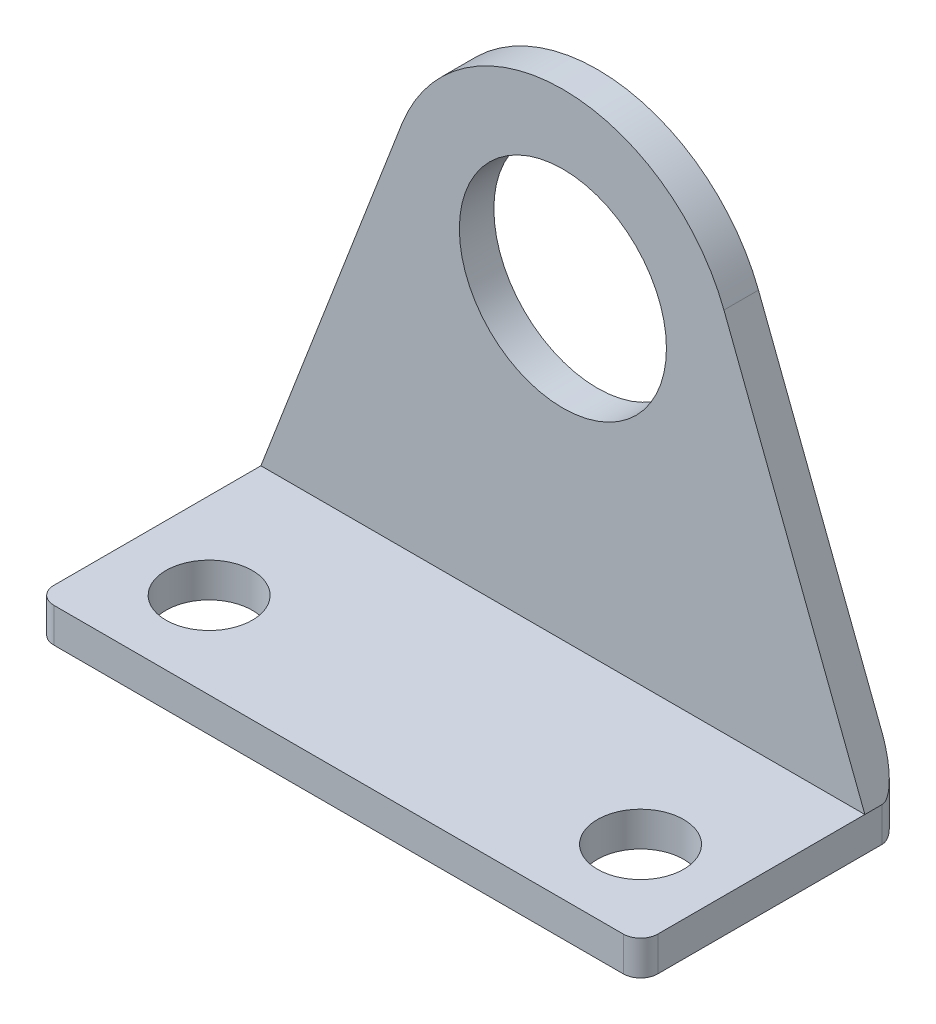
ISO-10303-21;
HEADER;
FILE_DESCRIPTION(('STEP AP214'),'2;1');
FILE_NAME('part.step','',(''),(''),'','','');
FILE_SCHEMA(('AUTOMOTIVE_DESIGN { 1 0 10303 214 1 1 1 1 }'));
ENDSEC;
DATA;
#1=APPLICATION_CONTEXT('core data for automotive mechanical design processes');
#2=APPLICATION_PROTOCOL_DEFINITION('international standard','automotive_design',2000,#1);
#3=PRODUCT_CONTEXT('',#1,'mechanical');
#4=PRODUCT('Part','Part','',(#3));
#5=PRODUCT_RELATED_PRODUCT_CATEGORY('part','',(#4));
#6=PRODUCT_DEFINITION_FORMATION('','',#4);
#7=PRODUCT_DEFINITION_CONTEXT('part definition',#1,'design');
#8=PRODUCT_DEFINITION('design','',#6,#7);
#9=PRODUCT_DEFINITION_SHAPE('','',#8);
#10=(LENGTH_UNIT() NAMED_UNIT(*) SI_UNIT(.MILLI.,.METRE.));
#11=(NAMED_UNIT(*) PLANE_ANGLE_UNIT() SI_UNIT($,.RADIAN.));
#12=(NAMED_UNIT(*) SI_UNIT($,.STERADIAN.) SOLID_ANGLE_UNIT());
#13=UNCERTAINTY_MEASURE_WITH_UNIT(LENGTH_MEASURE(1.E-05),#10,'distance_accuracy_value','');
#14=(GEOMETRIC_REPRESENTATION_CONTEXT(3) GLOBAL_UNCERTAINTY_ASSIGNED_CONTEXT((#13)) GLOBAL_UNIT_ASSIGNED_CONTEXT((#10,
#11,#12)) REPRESENTATION_CONTEXT('',''));
#15=CARTESIAN_POINT('',(0.,0.,0.));
#16=DIRECTION('',(0.,0.,1.));
#17=DIRECTION('',(1.,0.,0.));
#18=AXIS2_PLACEMENT_3D('',#15,#16,#17);
#19=CARTESIAN_POINT('',(0.,2.,0.));
#20=DIRECTION('',(1.,0.,0.));
#21=DIRECTION('',(0.,0.,-1.));
#22=AXIS2_PLACEMENT_3D('',#19,#20,#21);
#23=PLANE('',#22);
#24=DIRECTION('',(0.,0.,1.));
#25=VECTOR('',#24,1.);
#26=CARTESIAN_POINT('',(0.,0.,0.));
#27=LINE('',#26,#25);
#28=CARTESIAN_POINT('',(0.,0.,-14.));
#29=VERTEX_POINT('',#28);
#30=CARTESIAN_POINT('',(0.,0.,-1.));
#31=VERTEX_POINT('',#30);
#32=EDGE_CURVE('E159',#29,#31,#27,.T.);
#33=ORIENTED_EDGE('',*,*,#32,.T.);
#34=DIRECTION('',(0.,-1.,0.));
#35=VECTOR('',#34,1.);
#36=CARTESIAN_POINT('',(0.,2.,-1.));
#37=LINE('',#36,#35);
#38=CARTESIAN_POINT('',(0.,2.,-1.));
#39=VERTEX_POINT('',#38);
#40=EDGE_CURVE('E11',#31,#39,#37,.F.);
#41=ORIENTED_EDGE('',*,*,#40,.T.);
#42=DIRECTION('',(0.,0.,1.));
#43=VECTOR('',#42,1.);
#44=CARTESIAN_POINT('',(0.,2.,0.));
#45=LINE('',#44,#43);
#46=CARTESIAN_POINT('',(0.,2.,-13.));
#47=VERTEX_POINT('',#46);
#48=EDGE_CURVE('E169',#47,#39,#45,.T.);
#49=ORIENTED_EDGE('',*,*,#48,.F.);
#50=CARTESIAN_POINT('',(0.,2.,-14.));
#51=VERTEX_POINT('',#50);
#52=EDGE_CURVE('E167',#51,#47,#45,.T.);
#53=ORIENTED_EDGE('',*,*,#52,.F.);
#54=DIRECTION('',(0.,-1.,0.));
#55=VECTOR('',#54,1.);
#56=CARTESIAN_POINT('',(0.,2.,-14.));
#57=LINE('',#56,#55);
#58=EDGE_CURVE('E191',#51,#29,#57,.T.);
#59=ORIENTED_EDGE('',*,*,#58,.T.);
#60=EDGE_LOOP('',(#33,#41,#49,#53,#59));
#61=FACE_BOUND('',#60,.T.);
#62=ADVANCED_FACE('F39',(#61),#23,.F.);
#63=CARTESIAN_POINT('',(0.,2.,0.));
#64=DIRECTION('',(0.,0.,-1.));
#65=DIRECTION('',(-1.,0.,0.));
#66=AXIS2_PLACEMENT_3D('',#63,#64,#65);
#67=PLANE('',#66);
#68=DIRECTION('',(1.,0.,0.));
#69=VECTOR('',#68,1.);
#70=CARTESIAN_POINT('',(0.,0.,0.));
#71=LINE('',#70,#69);
#72=CARTESIAN_POINT('',(1.,0.,0.));
#73=VERTEX_POINT('',#72);
#74=CARTESIAN_POINT('',(34.,0.,0.));
#75=VERTEX_POINT('',#74);
#76=EDGE_CURVE('E161',#73,#75,#71,.T.);
#77=ORIENTED_EDGE('',*,*,#76,.T.);
#78=DIRECTION('',(0.,-1.,0.));
#79=VECTOR('',#78,1.);
#80=CARTESIAN_POINT('',(34.,2.,0.));
#81=LINE('',#80,#79);
#82=CARTESIAN_POINT('',(34.,2.,0.));
#83=VERTEX_POINT('',#82);
#84=EDGE_CURVE('E60',#75,#83,#81,.F.);
#85=ORIENTED_EDGE('',*,*,#84,.T.);
#86=DIRECTION('',(1.,0.,0.));
#87=VECTOR('',#86,1.);
#88=CARTESIAN_POINT('',(0.,2.,0.));
#89=LINE('',#88,#87);
#90=CARTESIAN_POINT('',(1.,2.,0.));
#91=VERTEX_POINT('',#90);
#92=EDGE_CURVE('E135',#91,#83,#89,.T.);
#93=ORIENTED_EDGE('',*,*,#92,.F.);
#94=DIRECTION('',(0.,-1.,0.));
#95=VECTOR('',#94,1.);
#96=CARTESIAN_POINT('',(1.,2.,0.));
#97=LINE('',#96,#95);
#98=EDGE_CURVE('E211',#91,#73,#97,.T.);
#99=ORIENTED_EDGE('',*,*,#98,.T.);
#100=EDGE_LOOP('',(#77,#85,#93,#99));
#101=FACE_BOUND('',#100,.T.);
#102=ADVANCED_FACE('F219',(#101),#67,.F.);
#103=CARTESIAN_POINT('',(35.,2.,0.));
#104=DIRECTION('',(-1.,0.,0.));
#105=DIRECTION('',(0.,0.,1.));
#106=AXIS2_PLACEMENT_3D('',#103,#104,#105);
#107=PLANE('',#106);
#108=DIRECTION('',(0.,0.,-1.));
#109=VECTOR('',#108,1.);
#110=CARTESIAN_POINT('',(35.,2.,0.));
#111=LINE('',#110,#109);
#112=CARTESIAN_POINT('',(35.,2.,-1.));
#113=VERTEX_POINT('',#112);
#114=CARTESIAN_POINT('',(35.,2.,-13.));
#115=VERTEX_POINT('',#114);
#116=EDGE_CURVE('E124',#113,#115,#111,.T.);
#117=ORIENTED_EDGE('',*,*,#116,.F.);
#118=DIRECTION('',(0.,-1.,0.));
#119=VECTOR('',#118,1.);
#120=CARTESIAN_POINT('',(35.,2.,-1.));
#121=LINE('',#120,#119);
#122=CARTESIAN_POINT('',(35.,0.,-1.));
#123=VERTEX_POINT('',#122);
#124=EDGE_CURVE('E198',#113,#123,#121,.T.);
#125=ORIENTED_EDGE('',*,*,#124,.T.);
#126=DIRECTION('',(0.,0.,-1.));
#127=VECTOR('',#126,1.);
#128=CARTESIAN_POINT('',(35.,0.,0.));
#129=LINE('',#128,#127);
#130=CARTESIAN_POINT('',(35.,0.,-14.));
#131=VERTEX_POINT('',#130);
#132=EDGE_CURVE('E172',#123,#131,#129,.T.);
#133=ORIENTED_EDGE('',*,*,#132,.T.);
#134=DIRECTION('',(0.,-1.,0.));
#135=VECTOR('',#134,1.);
#136=CARTESIAN_POINT('',(35.,2.,-14.));
#137=LINE('',#136,#135);
#138=CARTESIAN_POINT('',(35.,2.,-14.));
#139=VERTEX_POINT('',#138);
#140=EDGE_CURVE('E158',#131,#139,#137,.F.);
#141=ORIENTED_EDGE('',*,*,#140,.T.);
#142=DIRECTION('',(0.,0.,-1.));
#143=VECTOR('',#142,1.);
#144=CARTESIAN_POINT('',(35.,2.,-13.));
#145=LINE('',#144,#143);
#146=EDGE_CURVE('E142',#115,#139,#145,.T.);
#147=ORIENTED_EDGE('',*,*,#146,.F.);
#148=EDGE_LOOP('',(#117,#125,#133,#141,#147));
#149=FACE_BOUND('',#148,.T.);
#150=ADVANCED_FACE('F156',(#149),#107,.F.);
#151=CARTESIAN_POINT('',(0.,2.,-15.));
#152=DIRECTION('',(0.,0.,1.));
#153=DIRECTION('',(1.,0.,0.));
#154=AXIS2_PLACEMENT_3D('',#151,#152,#153);
#155=PLANE('',#154);
#156=CARTESIAN_POINT('',(17.5,19.6432234456318,-15.));
#157=DIRECTION('',(0.,0.,1.));
#158=DIRECTION('',(1.,0.,0.));
#159=AXIS2_PLACEMENT_3D('',#156,#157,#158);
#160=CIRCLE('',#159,6.);
#161=CARTESIAN_POINT('',(23.5,19.6432234456318,-15.));
#162=VERTEX_POINT('',#161);
#163=EDGE_CURVE('E249',#162,#162,#160,.T.);
#164=ORIENTED_EDGE('',*,*,#163,.T.);
#165=EDGE_LOOP('',(#164));
#166=FACE_BOUND('',#165,.T.);
#167=DIRECTION('',(0.358979079308869,-0.93334560620306,0.));
#168=VECTOR('',#167,1.);
#169=CARTESIAN_POINT('',(35.,2.,-15.));
#170=LINE('',#169,#168);
#171=CARTESIAN_POINT('',(26.8334560620306,23.2330142387205,-15.));
#172=VERTEX_POINT('',#171);
#173=CARTESIAN_POINT('',(34.,4.6,-15.));
#174=VERTEX_POINT('',#173);
#175=EDGE_CURVE('E205',#172,#174,#170,.T.);
#176=ORIENTED_EDGE('',*,*,#175,.T.);
#177=DIRECTION('',(0.,-1.,0.));
#178=VECTOR('',#177,1.);
#179=CARTESIAN_POINT('',(34.,2.,-15.));
#180=LINE('',#179,#178);
#181=CARTESIAN_POINT('',(34.,1.,-15.));
#182=VERTEX_POINT('',#181);
#183=EDGE_CURVE('E185',#174,#182,#180,.T.);
#184=ORIENTED_EDGE('',*,*,#183,.T.);
#185=DIRECTION('',(-1.,0.,0.));
#186=VECTOR('',#185,1.);
#187=CARTESIAN_POINT('',(0.,1.,-15.));
#188=LINE('',#187,#186);
#189=CARTESIAN_POINT('',(1.,1.,-15.));
#190=VERTEX_POINT('',#189);
#191=EDGE_CURVE('E181',#182,#190,#188,.T.);
#192=ORIENTED_EDGE('',*,*,#191,.T.);
#193=DIRECTION('',(0.,-1.,0.));
#194=VECTOR('',#193,1.);
#195=CARTESIAN_POINT('',(1.,2.,-15.));
#196=LINE('',#195,#194);
#197=CARTESIAN_POINT('',(0.999999999999997,4.6,-15.));
#198=VERTEX_POINT('',#197);
#199=EDGE_CURVE('E183',#190,#198,#196,.F.);
#200=ORIENTED_EDGE('',*,*,#199,.T.);
#201=DIRECTION('',(0.358979079308869,0.93334560620306,0.));
#202=VECTOR('',#201,1.);
#203=CARTESIAN_POINT('',(17.5,47.5,-15.));
#204=LINE('',#203,#202);
#205=CARTESIAN_POINT('',(8.1665439379694,23.2330142387205,-15.));
#206=VERTEX_POINT('',#205);
#207=EDGE_CURVE('E149',#198,#206,#204,.T.);
#208=ORIENTED_EDGE('',*,*,#207,.T.);
#209=CARTESIAN_POINT('',(17.5,19.6432234456318,-15.));
#210=DIRECTION('',(0.,0.,1.));
#211=DIRECTION('',(1.,0.,0.));
#212=AXIS2_PLACEMENT_3D('',#209,#210,#211);
#213=CIRCLE('',#212,10.);
#214=EDGE_CURVE('E176',#206,#172,#213,.F.);
#215=ORIENTED_EDGE('',*,*,#214,.T.);
#216=EDGE_LOOP('',(#176,#184,#192,#200,#208,#215));
#217=FACE_BOUND('',#216,.T.);
#218=ADVANCED_FACE('F242',(#166,#217),#155,.F.);
#219=CARTESIAN_POINT('',(0.,2.,0.));
#220=DIRECTION('',(0.,-1.,0.));
#221=DIRECTION('',(0.,0.,-1.));
#222=AXIS2_PLACEMENT_3D('',#219,#220,#221);
#223=PLANE('',#222);
#224=CARTESIAN_POINT('',(5.,2.,-5.));
#225=DIRECTION('',(0.,1.,0.));
#226=DIRECTION('',(0.,0.,1.));
#227=AXIS2_PLACEMENT_3D('',#224,#225,#226);
#228=CIRCLE('',#227,2.5);
#229=CARTESIAN_POINT('',(5.,2.,-2.5));
#230=VERTEX_POINT('',#229);
#231=EDGE_CURVE('E252',#230,#230,#228,.T.);
#232=ORIENTED_EDGE('',*,*,#231,.F.);
#233=EDGE_LOOP('',(#232));
#234=FACE_BOUND('',#233,.T.);
#235=CARTESIAN_POINT('',(30.,2.,-5.));
#236=DIRECTION('',(0.,1.,0.));
#237=DIRECTION('',(0.,0.,1.));
#238=AXIS2_PLACEMENT_3D('',#235,#236,#237);
#239=CIRCLE('',#238,2.5);
#240=CARTESIAN_POINT('',(30.,2.,-2.5));
#241=VERTEX_POINT('',#240);
#242=EDGE_CURVE('E248',#241,#241,#239,.T.);
#243=ORIENTED_EDGE('',*,*,#242,.F.);
#244=EDGE_LOOP('',(#243));
#245=FACE_BOUND('',#244,.T.);
#246=ORIENTED_EDGE('',*,*,#92,.T.);
#247=CARTESIAN_POINT('',(34.,2.,-1.));
#248=DIRECTION('',(0.,-1.,0.));
#249=DIRECTION('',(0.,0.,-1.));
#250=AXIS2_PLACEMENT_3D('',#247,#248,#249);
#251=CIRCLE('',#250,1.);
#252=EDGE_CURVE('E47',#83,#113,#251,.F.);
#253=ORIENTED_EDGE('',*,*,#252,.T.);
#254=ORIENTED_EDGE('',*,*,#116,.T.);
#255=DIRECTION('',(-1.,0.,0.));
#256=VECTOR('',#255,1.);
#257=CARTESIAN_POINT('',(0.,2.,-13.));
#258=LINE('',#257,#256);
#259=EDGE_CURVE('E128',#115,#47,#258,.T.);
#260=ORIENTED_EDGE('',*,*,#259,.T.);
#261=ORIENTED_EDGE('',*,*,#48,.T.);
#262=CARTESIAN_POINT('',(1.,2.,-1.));
#263=DIRECTION('',(0.,-1.,0.));
#264=DIRECTION('',(0.,0.,-1.));
#265=AXIS2_PLACEMENT_3D('',#262,#263,#264);
#266=CIRCLE('',#265,1.);
#267=EDGE_CURVE('E215',#39,#91,#266,.F.);
#268=ORIENTED_EDGE('',*,*,#267,.T.);
#269=EDGE_LOOP('',(#246,#253,#254,#260,#261,#268));
#270=FACE_BOUND('',#269,.T.);
#271=ADVANCED_FACE('F126',(#234,#245,#270),#223,.F.);
#272=CARTESIAN_POINT('',(0.,0.,0.));
#273=DIRECTION('',(0.,-1.,0.));
#274=DIRECTION('',(0.,0.,-1.));
#275=AXIS2_PLACEMENT_3D('',#272,#273,#274);
#276=PLANE('',#275);
#277=CARTESIAN_POINT('',(5.,0.,-5.));
#278=DIRECTION('',(0.,1.,0.));
#279=DIRECTION('',(0.,0.,1.));
#280=AXIS2_PLACEMENT_3D('',#277,#278,#279);
#281=CIRCLE('',#280,2.5);
#282=CARTESIAN_POINT('',(5.,0.,-2.5));
#283=VERTEX_POINT('',#282);
#284=EDGE_CURVE('E202',#283,#283,#281,.T.);
#285=ORIENTED_EDGE('',*,*,#284,.T.);
#286=EDGE_LOOP('',(#285));
#287=FACE_BOUND('',#286,.T.);
#288=CARTESIAN_POINT('',(30.,0.,-5.));
#289=DIRECTION('',(0.,1.,0.));
#290=DIRECTION('',(0.,0.,1.));
#291=AXIS2_PLACEMENT_3D('',#288,#289,#290);
#292=CIRCLE('',#291,2.5);
#293=CARTESIAN_POINT('',(30.,0.,-2.5));
#294=VERTEX_POINT('',#293);
#295=EDGE_CURVE('E245',#294,#294,#292,.T.);
#296=ORIENTED_EDGE('',*,*,#295,.T.);
#297=EDGE_LOOP('',(#296));
#298=FACE_BOUND('',#297,.T.);
#299=ORIENTED_EDGE('',*,*,#132,.F.);
#300=CARTESIAN_POINT('',(34.,0.,-1.));
#301=DIRECTION('',(0.,-1.,0.));
#302=DIRECTION('',(0.,0.,-1.));
#303=AXIS2_PLACEMENT_3D('',#300,#301,#302);
#304=CIRCLE('',#303,1.);
#305=EDGE_CURVE('E209',#123,#75,#304,.T.);
#306=ORIENTED_EDGE('',*,*,#305,.T.);
#307=ORIENTED_EDGE('',*,*,#76,.F.);
#308=CARTESIAN_POINT('',(1.,0.,-1.));
#309=DIRECTION('',(0.,-1.,0.));
#310=DIRECTION('',(0.,0.,-1.));
#311=AXIS2_PLACEMENT_3D('',#308,#309,#310);
#312=CIRCLE('',#311,1.);
#313=EDGE_CURVE('E207',#73,#31,#312,.T.);
#314=ORIENTED_EDGE('',*,*,#313,.T.);
#315=ORIENTED_EDGE('',*,*,#32,.F.);
#316=DIRECTION('',(-1.,0.,0.));
#317=VECTOR('',#316,1.);
#318=CARTESIAN_POINT('',(35.,0.,-14.));
#319=LINE('',#318,#317);
#320=EDGE_CURVE('E195',#29,#131,#319,.F.);
#321=ORIENTED_EDGE('',*,*,#320,.T.);
#322=EDGE_LOOP('',(#299,#306,#307,#314,#315,#321));
#323=FACE_BOUND('',#322,.T.);
#324=ADVANCED_FACE('F224',(#287,#298,#323),#276,.T.);
#325=CARTESIAN_POINT('',(35.,2.,-13.));
#326=DIRECTION('',(0.93334560620306,0.358979079308869,0.));
#327=DIRECTION('',(-0.358979079308869,0.93334560620306,0.));
#328=AXIS2_PLACEMENT_3D('',#325,#326,#327);
#329=PLANE('',#328);
#330=ORIENTED_EDGE('',*,*,#146,.T.);
#331=CARTESIAN_POINT('',(34.,4.6,-14.));
#332=DIRECTION('',(0.93334560620306,0.358979079308869,0.));
#333=DIRECTION('',(0.358979079308869,-0.93334560620306,0.));
#334=AXIS2_PLACEMENT_3D('',#331,#332,#333);
#335=ELLIPSE('',#334,2.78567765543682,1.);
#336=EDGE_CURVE('E189',#139,#174,#335,.T.);
#337=ORIENTED_EDGE('',*,*,#336,.T.);
#338=ORIENTED_EDGE('',*,*,#175,.F.);
#339=DIRECTION('',(0.,0.,-1.));
#340=VECTOR('',#339,1.);
#341=CARTESIAN_POINT('',(26.8334560620306,23.2330142387205,-13.));
#342=LINE('',#341,#340);
#343=CARTESIAN_POINT('',(26.8334560620306,23.2330142387205,-13.));
#344=VERTEX_POINT('',#343);
#345=EDGE_CURVE('E146',#172,#344,#342,.F.);
#346=ORIENTED_EDGE('',*,*,#345,.T.);
#347=DIRECTION('',(0.358979079308869,-0.93334560620306,0.));
#348=VECTOR('',#347,1.);
#349=CARTESIAN_POINT('',(35.,2.,-13.));
#350=LINE('',#349,#348);
#351=EDGE_CURVE('E140',#344,#115,#350,.T.);
#352=ORIENTED_EDGE('',*,*,#351,.T.);
#353=EDGE_LOOP('',(#330,#337,#338,#346,#352));
#354=FACE_BOUND('',#353,.T.);
#355=ADVANCED_FACE('F141',(#354),#329,.T.);
#356=CARTESIAN_POINT('',(17.5,47.5,-13.));
#357=DIRECTION('',(-0.93334560620306,0.358979079308869,0.));
#358=DIRECTION('',(-0.358979079308869,-0.93334560620306,0.));
#359=AXIS2_PLACEMENT_3D('',#356,#357,#358);
#360=PLANE('',#359);
#361=ORIENTED_EDGE('',*,*,#207,.F.);
#362=CARTESIAN_POINT('',(1.,4.6,-14.));
#363=DIRECTION('',(-0.93334560620306,0.358979079308869,0.));
#364=DIRECTION('',(-0.358979079308869,-0.93334560620306,0.));
#365=AXIS2_PLACEMENT_3D('',#362,#363,#364);
#366=ELLIPSE('',#365,2.78567765543682,1.);
#367=EDGE_CURVE('E193',#198,#51,#366,.T.);
#368=ORIENTED_EDGE('',*,*,#367,.T.);
#369=ORIENTED_EDGE('',*,*,#52,.T.);
#370=DIRECTION('',(0.358979079308869,0.93334560620306,0.));
#371=VECTOR('',#370,1.);
#372=CARTESIAN_POINT('',(17.5,47.5,-13.));
#373=LINE('',#372,#371);
#374=CARTESIAN_POINT('',(8.1665439379694,23.2330142387205,-13.));
#375=VERTEX_POINT('',#374);
#376=EDGE_CURVE('E154',#47,#375,#373,.T.);
#377=ORIENTED_EDGE('',*,*,#376,.T.);
#378=DIRECTION('',(0.,0.,-1.));
#379=VECTOR('',#378,1.);
#380=CARTESIAN_POINT('',(8.16654393796941,23.2330142387205,-13.));
#381=LINE('',#380,#379);
#382=EDGE_CURVE('E134',#375,#206,#381,.T.);
#383=ORIENTED_EDGE('',*,*,#382,.T.);
#384=EDGE_LOOP('',(#361,#368,#369,#377,#383));
#385=FACE_BOUND('',#384,.T.);
#386=ADVANCED_FACE('F273',(#385),#360,.T.);
#387=CARTESIAN_POINT('',(0.,0.,-13.));
#388=DIRECTION('',(0.,0.,-1.));
#389=DIRECTION('',(-1.,0.,0.));
#390=AXIS2_PLACEMENT_3D('',#387,#388,#389);
#391=PLANE('',#390);
#392=CARTESIAN_POINT('',(17.5,19.6432234456318,-13.));
#393=DIRECTION('',(0.,0.,1.));
#394=DIRECTION('',(1.,0.,0.));
#395=AXIS2_PLACEMENT_3D('',#392,#393,#394);
#396=CIRCLE('',#395,6.);
#397=CARTESIAN_POINT('',(23.5,19.6432234456318,-13.));
#398=VERTEX_POINT('',#397);
#399=EDGE_CURVE('E257',#398,#398,#396,.T.);
#400=ORIENTED_EDGE('',*,*,#399,.F.);
#401=EDGE_LOOP('',(#400));
#402=FACE_BOUND('',#401,.T.);
#403=ORIENTED_EDGE('',*,*,#351,.F.);
#404=CARTESIAN_POINT('',(17.5,19.6432234456318,-13.));
#405=DIRECTION('',(0.,0.,-1.));
#406=DIRECTION('',(-1.,0.,0.));
#407=AXIS2_PLACEMENT_3D('',#404,#405,#406);
#408=CIRCLE('',#407,10.);
#409=EDGE_CURVE('E179',#344,#375,#408,.F.);
#410=ORIENTED_EDGE('',*,*,#409,.T.);
#411=ORIENTED_EDGE('',*,*,#376,.F.);
#412=ORIENTED_EDGE('',*,*,#259,.F.);
#413=EDGE_LOOP('',(#403,#410,#411,#412));
#414=FACE_BOUND('',#413,.T.);
#415=ADVANCED_FACE('F152',(#402,#414),#391,.F.);
#416=CARTESIAN_POINT('',(17.5,19.6432234456318,-13.));
#417=DIRECTION('',(0.,0.,-1.));
#418=DIRECTION('',(-1.,0.,0.));
#419=AXIS2_PLACEMENT_3D('',#416,#417,#418);
#420=CYLINDRICAL_SURFACE('',#419,10.);
#421=ORIENTED_EDGE('',*,*,#409,.F.);
#422=ORIENTED_EDGE('',*,*,#345,.F.);
#423=ORIENTED_EDGE('',*,*,#214,.F.);
#424=ORIENTED_EDGE('',*,*,#382,.F.);
#425=EDGE_LOOP('',(#421,#422,#423,#424));
#426=FACE_BOUND('',#425,.T.);
#427=ADVANCED_FACE('F272',(#426),#420,.T.);
#428=CARTESIAN_POINT('',(1.,2.,-14.));
#429=DIRECTION('',(0.,-1.,0.));
#430=DIRECTION('',(0.,0.,-1.));
#431=AXIS2_PLACEMENT_3D('',#428,#429,#430);
#432=CYLINDRICAL_SURFACE('',#431,1.);
#433=ORIENTED_EDGE('',*,*,#367,.F.);
#434=ORIENTED_EDGE('',*,*,#199,.F.);
#435=CARTESIAN_POINT('',(1.,1.,-14.));
#436=DIRECTION('',(0.707106781186547,-0.707106781186547,0.));
#437=DIRECTION('',(0.707106781186547,0.707106781186547,0.));
#438=AXIS2_PLACEMENT_3D('',#435,#436,#437);
#439=ELLIPSE('',#438,1.41421356237309,1.);
#440=EDGE_CURVE('E201',#29,#190,#439,.T.);
#441=ORIENTED_EDGE('',*,*,#440,.F.);
#442=ORIENTED_EDGE('',*,*,#58,.F.);
#443=EDGE_LOOP('',(#433,#434,#441,#442));
#444=FACE_BOUND('',#443,.T.);
#445=ADVANCED_FACE('F230',(#444),#432,.T.);
#446=CARTESIAN_POINT('',(0.,1.,-14.));
#447=DIRECTION('',(1.,0.,0.));
#448=DIRECTION('',(0.,0.,-1.));
#449=AXIS2_PLACEMENT_3D('',#446,#447,#448);
#450=CYLINDRICAL_SURFACE('',#449,1.);
#451=ORIENTED_EDGE('',*,*,#440,.T.);
#452=ORIENTED_EDGE('',*,*,#191,.F.);
#453=CARTESIAN_POINT('',(34.,1.,-14.));
#454=DIRECTION('',(0.707106781186547,0.707106781186547,0.));
#455=DIRECTION('',(0.707106781186547,-0.707106781186547,0.));
#456=AXIS2_PLACEMENT_3D('',#453,#454,#455);
#457=ELLIPSE('',#456,1.41421356237309,1.);
#458=EDGE_CURVE('E199',#131,#182,#457,.T.);
#459=ORIENTED_EDGE('',*,*,#458,.F.);
#460=ORIENTED_EDGE('',*,*,#320,.F.);
#461=EDGE_LOOP('',(#451,#452,#459,#460));
#462=FACE_BOUND('',#461,.T.);
#463=ADVANCED_FACE('F236',(#462),#450,.T.);
#464=CARTESIAN_POINT('',(34.,2.,-14.));
#465=DIRECTION('',(0.,-1.,0.));
#466=DIRECTION('',(0.,0.,-1.));
#467=AXIS2_PLACEMENT_3D('',#464,#465,#466);
#468=CYLINDRICAL_SURFACE('',#467,1.);
#469=ORIENTED_EDGE('',*,*,#336,.F.);
#470=ORIENTED_EDGE('',*,*,#140,.F.);
#471=ORIENTED_EDGE('',*,*,#458,.T.);
#472=ORIENTED_EDGE('',*,*,#183,.F.);
#473=EDGE_LOOP('',(#469,#470,#471,#472));
#474=FACE_BOUND('',#473,.T.);
#475=ADVANCED_FACE('F238',(#474),#468,.T.);
#476=CARTESIAN_POINT('',(34.,2.,-1.));
#477=DIRECTION('',(0.,-1.,0.));
#478=DIRECTION('',(0.,0.,-1.));
#479=AXIS2_PLACEMENT_3D('',#476,#477,#478);
#480=CYLINDRICAL_SURFACE('',#479,1.);
#481=ORIENTED_EDGE('',*,*,#252,.F.);
#482=ORIENTED_EDGE('',*,*,#84,.F.);
#483=ORIENTED_EDGE('',*,*,#305,.F.);
#484=ORIENTED_EDGE('',*,*,#124,.F.);
#485=EDGE_LOOP('',(#481,#482,#483,#484));
#486=FACE_BOUND('',#485,.T.);
#487=ADVANCED_FACE('F294',(#486),#480,.T.);
#488=CARTESIAN_POINT('',(1.,2.,-1.));
#489=DIRECTION('',(0.,-1.,0.));
#490=DIRECTION('',(0.,0.,-1.));
#491=AXIS2_PLACEMENT_3D('',#488,#489,#490);
#492=CYLINDRICAL_SURFACE('',#491,1.);
#493=ORIENTED_EDGE('',*,*,#267,.F.);
#494=ORIENTED_EDGE('',*,*,#40,.F.);
#495=ORIENTED_EDGE('',*,*,#313,.F.);
#496=ORIENTED_EDGE('',*,*,#98,.F.);
#497=EDGE_LOOP('',(#493,#494,#495,#496));
#498=FACE_BOUND('',#497,.T.);
#499=ADVANCED_FACE('F41',(#498),#492,.T.);
#500=CARTESIAN_POINT('',(30.,0.,-5.));
#501=DIRECTION('',(0.,1.,0.));
#502=DIRECTION('',(0.,0.,1.));
#503=AXIS2_PLACEMENT_3D('',#500,#501,#502);
#504=CYLINDRICAL_SURFACE('',#503,2.5);
#505=ORIENTED_EDGE('',*,*,#295,.F.);
#506=EDGE_LOOP('',(#505));
#507=FACE_BOUND('',#506,.T.);
#508=ORIENTED_EDGE('',*,*,#242,.T.);
#509=EDGE_LOOP('',(#508));
#510=FACE_BOUND('',#509,.T.);
#511=ADVANCED_FACE('F303',(#507,#510),#504,.F.);
#512=CARTESIAN_POINT('',(5.,0.,-5.));
#513=DIRECTION('',(0.,1.,0.));
#514=DIRECTION('',(0.,0.,1.));
#515=AXIS2_PLACEMENT_3D('',#512,#513,#514);
#516=CYLINDRICAL_SURFACE('',#515,2.5);
#517=ORIENTED_EDGE('',*,*,#284,.F.);
#518=EDGE_LOOP('',(#517));
#519=FACE_BOUND('',#518,.T.);
#520=ORIENTED_EDGE('',*,*,#231,.T.);
#521=EDGE_LOOP('',(#520));
#522=FACE_BOUND('',#521,.T.);
#523=ADVANCED_FACE('F267',(#519,#522),#516,.F.);
#524=CARTESIAN_POINT('',(17.5,19.6432234456318,-15.));
#525=DIRECTION('',(0.,0.,1.));
#526=DIRECTION('',(1.,0.,0.));
#527=AXIS2_PLACEMENT_3D('',#524,#525,#526);
#528=CYLINDRICAL_SURFACE('',#527,6.);
#529=ORIENTED_EDGE('',*,*,#163,.F.);
#530=EDGE_LOOP('',(#529));
#531=FACE_BOUND('',#530,.T.);
#532=ORIENTED_EDGE('',*,*,#399,.T.);
#533=EDGE_LOOP('',(#532));
#534=FACE_BOUND('',#533,.T.);
#535=ADVANCED_FACE('F264',(#531,#534),#528,.F.);
#536=CLOSED_SHELL('',(#62,#102,#150,#218,#271,#324,#355,#386,#415,#427,#445,#463,#475,#487,#499,
#511,#523,#535));
#537=MANIFOLD_SOLID_BREP('B2',#536);
#538=ADVANCED_BREP_SHAPE_REPRESENTATION('',(#18,#537),#14);
#539=SHAPE_DEFINITION_REPRESENTATION(#9,#538);
ENDSEC;
END-ISO-10303-21;
